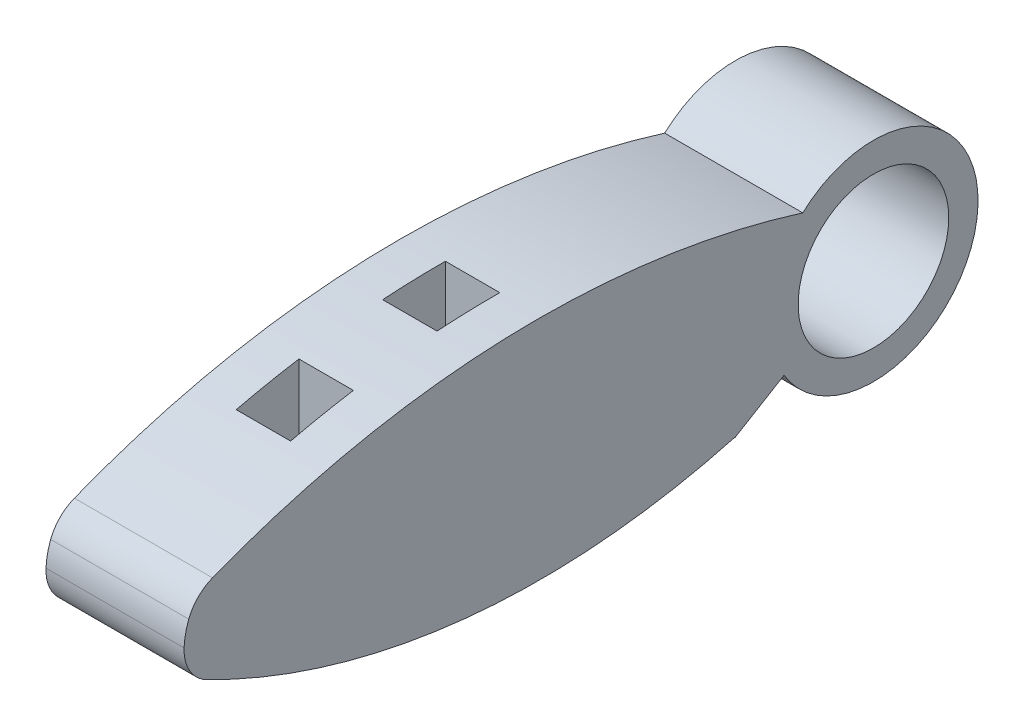
ISO-10303-21;
HEADER;
FILE_DESCRIPTION(('STEP AP214'),'2;1');
FILE_NAME('part.step','',(''),(''),'','','');
FILE_SCHEMA(('AUTOMOTIVE_DESIGN { 1 0 10303 214 1 1 1 1 }'));
ENDSEC;
DATA;
#1=APPLICATION_CONTEXT('core data for automotive mechanical design processes');
#2=APPLICATION_PROTOCOL_DEFINITION('international standard','automotive_design',2000,#1);
#3=PRODUCT_CONTEXT('',#1,'mechanical');
#4=PRODUCT('Part','Part','',(#3));
#5=PRODUCT_RELATED_PRODUCT_CATEGORY('part','',(#4));
#6=PRODUCT_DEFINITION_FORMATION('','',#4);
#7=PRODUCT_DEFINITION_CONTEXT('part definition',#1,'design');
#8=PRODUCT_DEFINITION('design','',#6,#7);
#9=PRODUCT_DEFINITION_SHAPE('','',#8);
#10=(LENGTH_UNIT() NAMED_UNIT(*) SI_UNIT(.MILLI.,.METRE.));
#11=(NAMED_UNIT(*) PLANE_ANGLE_UNIT() SI_UNIT($,.RADIAN.));
#12=(NAMED_UNIT(*) SI_UNIT($,.STERADIAN.) SOLID_ANGLE_UNIT());
#13=UNCERTAINTY_MEASURE_WITH_UNIT(LENGTH_MEASURE(1.E-05),#10,'distance_accuracy_value','');
#14=(GEOMETRIC_REPRESENTATION_CONTEXT(3) GLOBAL_UNCERTAINTY_ASSIGNED_CONTEXT((#13)) GLOBAL_UNIT_ASSIGNED_CONTEXT((#10,
#11,#12)) REPRESENTATION_CONTEXT('',''));
#15=CARTESIAN_POINT('',(0.,0.,0.));
#16=DIRECTION('',(0.,0.,1.));
#17=DIRECTION('',(1.,0.,0.));
#18=AXIS2_PLACEMENT_3D('',#15,#16,#17);
#19=CARTESIAN_POINT('',(3.048,-3.048,-10.7011292120376));
#20=DIRECTION('',(-1.,0.,0.));
#21=DIRECTION('',(0.,0.,1.));
#22=AXIS2_PLACEMENT_3D('',#19,#20,#21);
#23=PLANE('',#22);
#24=CARTESIAN_POINT('',(3.048,1.7367728611507,0.782716442123456));
#25=DIRECTION('',(-1.,0.,0.));
#26=DIRECTION('',(0.,0.,-1.));
#27=AXIS2_PLACEMENT_3D('',#24,#25,#26);
#28=CIRCLE('',#27,7.35917691072679);
#29=CARTESIAN_POINT('',(3.048,-3.048,-4.80865489866317));
#30=VERTEX_POINT('',#29);
#31=CARTESIAN_POINT('',(3.048,-4.80771955164062,4.14829274675408));
#32=VERTEX_POINT('',#31);
#33=EDGE_CURVE('E239',#30,#32,#28,.T.);
#34=ORIENTED_EDGE('',*,*,#33,.T.);
#35=CARTESIAN_POINT('',(3.048,0.,0.));
#36=DIRECTION('',(-1.,0.,0.));
#37=DIRECTION('',(0.,0.,1.));
#38=AXIS2_PLACEMENT_3D('',#35,#36,#37);
#39=CIRCLE('',#38,6.35);
#40=CARTESIAN_POINT('',(3.048,-3.048,-5.57065489866317));
#41=VERTEX_POINT('',#40);
#42=EDGE_CURVE('E311',#41,#32,#39,.T.);
#43=ORIENTED_EDGE('',*,*,#42,.F.);
#44=DIRECTION('',(0.,0.,-1.));
#45=VECTOR('',#44,1.);
#46=CARTESIAN_POINT('',(3.048,-3.048,-10.7011292120376));
#47=LINE('',#46,#45);
#48=EDGE_CURVE('E266',#30,#41,#47,.T.);
#49=ORIENTED_EDGE('',*,*,#48,.F.);
#50=EDGE_LOOP('',(#34,#43,#49));
#51=FACE_BOUND('',#50,.T.);
#52=ADVANCED_FACE('F36',(#51),#23,.F.);
#53=DIRECTION('',(0.,0.,1.));
#54=VECTOR('',#53,1.);
#55=CARTESIAN_POINT('',(3.048,-5.08,31.75));
#56=LINE('',#55,#54);
#57=CARTESIAN_POINT('',(3.048,-5.08,8.40578465095881));
#58=VERTEX_POINT('',#57);
#59=CARTESIAN_POINT('',(3.048,-5.08,8.49355854680419));
#60=VERTEX_POINT('',#59);
#61=EDGE_CURVE('E309',#58,#60,#56,.T.);
#62=ORIENTED_EDGE('',*,*,#61,.F.);
#63=DIRECTION('',(0.,-0.514252883928359,0.857638601843087));
#64=VECTOR('',#63,1.);
#65=CARTESIAN_POINT('',(3.048,-5.08,8.40578465095881));
#66=LINE('',#65,#64);
#67=CARTESIAN_POINT('',(3.048,-3.97792733114433,6.56781719878497));
#68=VERTEX_POINT('',#67);
#69=EDGE_CURVE('E447',#58,#68,#66,.F.);
#70=ORIENTED_EDGE('',*,*,#69,.T.);
#71=DIRECTION('',(0.,0.0683435239522143,0.99766184788925));
#72=VECTOR('',#71,1.);
#73=CARTESIAN_POINT('',(3.048,-3.048,20.1426662253124));
#74=LINE('',#73,#72);
#75=CARTESIAN_POINT('',(3.048,-3.048,20.1426662253124));
#76=VERTEX_POINT('',#75);
#77=EDGE_CURVE('E254',#68,#76,#74,.T.);
#78=ORIENTED_EDGE('',*,*,#77,.T.);
#79=DIRECTION('',(0.,-1.,0.));
#80=VECTOR('',#79,1.);
#81=CARTESIAN_POINT('',(3.048,-7.62,20.1426662253124));
#82=LINE('',#81,#80);
#83=CARTESIAN_POINT('',(3.048,-6.63947360129285,20.1426662253124));
#84=VERTEX_POINT('',#83);
#85=EDGE_CURVE('E306',#76,#84,#82,.T.);
#86=ORIENTED_EDGE('',*,*,#85,.T.);
#87=CARTESIAN_POINT('',(3.048,38.0452349807354,20.1956994380599));
#88=DIRECTION('',(-1.,0.,0.));
#89=DIRECTION('',(0.,0.,1.));
#90=AXIS2_PLACEMENT_3D('',#87,#88,#89);
#91=CIRCLE('',#90,44.6847400527568);
#92=EDGE_CURVE('E307',#84,#60,#91,.F.);
#93=ORIENTED_EDGE('',*,*,#92,.T.);
#94=EDGE_LOOP('',(#62,#70,#78,#86,#93));
#95=FACE_BOUND('',#94,.T.);
#96=ADVANCED_FACE('F486',(#95),#23,.F.);
#97=CARTESIAN_POINT('',(5.334,-3.048,-10.7011292120376));
#98=DIRECTION('',(1.,0.,0.));
#99=DIRECTION('',(0.,0.,-1.));
#100=AXIS2_PLACEMENT_3D('',#97,#98,#99);
#101=PLANE('',#100);
#102=CARTESIAN_POINT('',(5.334,1.7367728611507,0.782716442123456));
#103=DIRECTION('',(-1.,0.,0.));
#104=DIRECTION('',(0.,0.,-1.));
#105=AXIS2_PLACEMENT_3D('',#102,#103,#104);
#106=CIRCLE('',#105,7.35917691072679);
#107=CARTESIAN_POINT('',(5.334,-3.048,-4.80865489866317));
#108=VERTEX_POINT('',#107);
#109=CARTESIAN_POINT('',(5.334,-4.80771955164062,4.14829274675408));
#110=VERTEX_POINT('',#109);
#111=EDGE_CURVE('E259',#108,#110,#106,.T.);
#112=ORIENTED_EDGE('',*,*,#111,.F.);
#113=DIRECTION('',(0.,0.,1.));
#114=VECTOR('',#113,1.);
#115=CARTESIAN_POINT('',(5.334,-3.048,-10.7011292120376));
#116=LINE('',#115,#114);
#117=CARTESIAN_POINT('',(5.334,-3.048,-5.57065489866317));
#118=VERTEX_POINT('',#117);
#119=EDGE_CURVE('E273',#118,#108,#116,.T.);
#120=ORIENTED_EDGE('',*,*,#119,.F.);
#121=CARTESIAN_POINT('',(5.334,0.,0.));
#122=DIRECTION('',(1.,0.,0.));
#123=DIRECTION('',(0.,0.,-1.));
#124=AXIS2_PLACEMENT_3D('',#121,#122,#123);
#125=CIRCLE('',#124,6.35);
#126=EDGE_CURVE('E300',#110,#118,#125,.T.);
#127=ORIENTED_EDGE('',*,*,#126,.F.);
#128=EDGE_LOOP('',(#112,#120,#127));
#129=FACE_BOUND('',#128,.T.);
#130=ADVANCED_FACE('F514',(#129),#101,.F.);
#131=DIRECTION('',(0.,0.0683435239522143,0.99766184788925));
#132=VECTOR('',#131,1.);
#133=CARTESIAN_POINT('',(5.334,-3.048,20.1426662253124));
#134=LINE('',#133,#132);
#135=CARTESIAN_POINT('',(5.334,-3.97792733114433,6.56781719878497));
#136=VERTEX_POINT('',#135);
#137=CARTESIAN_POINT('',(5.334,-3.048,20.1426662253124));
#138=VERTEX_POINT('',#137);
#139=EDGE_CURVE('E261',#136,#138,#134,.T.);
#140=ORIENTED_EDGE('',*,*,#139,.F.);
#141=DIRECTION('',(0.,0.514252883928359,-0.857638601843087));
#142=VECTOR('',#141,1.);
#143=CARTESIAN_POINT('',(5.334,-5.08,8.40578465095881));
#144=LINE('',#143,#142);
#145=CARTESIAN_POINT('',(5.334,-5.08,8.40578465095881));
#146=VERTEX_POINT('',#145);
#147=EDGE_CURVE('E457',#136,#146,#144,.F.);
#148=ORIENTED_EDGE('',*,*,#147,.T.);
#149=DIRECTION('',(0.,0.,-1.));
#150=VECTOR('',#149,1.);
#151=CARTESIAN_POINT('',(5.334,-5.08,31.75));
#152=LINE('',#151,#150);
#153=CARTESIAN_POINT('',(5.334,-5.08,8.49355854680419));
#154=VERTEX_POINT('',#153);
#155=EDGE_CURVE('E297',#154,#146,#152,.T.);
#156=ORIENTED_EDGE('',*,*,#155,.F.);
#157=CARTESIAN_POINT('',(5.334,38.0452349807354,20.1956994380599));
#158=DIRECTION('',(1.,0.,0.));
#159=DIRECTION('',(0.,0.,-1.));
#160=AXIS2_PLACEMENT_3D('',#157,#158,#159);
#161=CIRCLE('',#160,44.6847400527568);
#162=CARTESIAN_POINT('',(5.334,-6.63947360129285,20.1426662253124));
#163=VERTEX_POINT('',#162);
#164=EDGE_CURVE('E294',#154,#163,#161,.F.);
#165=ORIENTED_EDGE('',*,*,#164,.T.);
#166=DIRECTION('',(0.,1.,0.));
#167=VECTOR('',#166,1.);
#168=CARTESIAN_POINT('',(5.334,-7.62,20.1426662253124));
#169=LINE('',#168,#167);
#170=EDGE_CURVE('E293',#163,#138,#169,.T.);
#171=ORIENTED_EDGE('',*,*,#170,.T.);
#172=EDGE_LOOP('',(#140,#148,#156,#165,#171));
#173=FACE_BOUND('',#172,.T.);
#174=ADVANCED_FACE('F474',(#173),#101,.F.);
#175=CARTESIAN_POINT('',(0.,-3.048,0.));
#176=DIRECTION('',(0.,1.,0.));
#177=DIRECTION('',(0.,0.,1.));
#178=AXIS2_PLACEMENT_3D('',#175,#176,#177);
#179=PLANE('',#178);
#180=DIRECTION('',(1.,0.,0.));
#181=VECTOR('',#180,1.);
#182=CARTESIAN_POINT('',(3.048,-3.048,-4.80865489866317));
#183=LINE('',#182,#181);
#184=EDGE_CURVE('E249',#30,#108,#183,.T.);
#185=ORIENTED_EDGE('',*,*,#184,.F.);
#186=ORIENTED_EDGE('',*,*,#48,.T.);
#187=DIRECTION('',(-1.,0.,0.));
#188=VECTOR('',#187,1.);
#189=CARTESIAN_POINT('',(8.382,-3.048,-5.57065489866317));
#190=LINE('',#189,#188);
#191=EDGE_CURVE('E286',#118,#41,#190,.T.);
#192=ORIENTED_EDGE('',*,*,#191,.F.);
#193=ORIENTED_EDGE('',*,*,#119,.T.);
#194=EDGE_LOOP('',(#185,#186,#192,#193));
#195=FACE_BOUND('',#194,.T.);
#196=ADVANCED_FACE('F511',(#195),#179,.F.);
#197=CARTESIAN_POINT('',(0.,-5.08,31.75));
#198=DIRECTION('',(0.,1.,0.));
#199=DIRECTION('',(0.,0.,1.));
#200=AXIS2_PLACEMENT_3D('',#197,#198,#199);
#201=PLANE('',#200);
#202=DIRECTION('',(0.,0.,-1.));
#203=VECTOR('',#202,1.);
#204=CARTESIAN_POINT('',(0.,-5.08,31.75));
#205=LINE('',#204,#203);
#206=CARTESIAN_POINT('',(0.,-5.08,8.49355854680419));
#207=VERTEX_POINT('',#206);
#208=CARTESIAN_POINT('',(0.,-5.08,8.40578465095881));
#209=VERTEX_POINT('',#208);
#210=EDGE_CURVE('E386',#207,#209,#205,.T.);
#211=ORIENTED_EDGE('',*,*,#210,.T.);
#212=DIRECTION('',(1.,0.,0.));
#213=VECTOR('',#212,1.);
#214=CARTESIAN_POINT('',(0.,-5.08,8.40578465095881));
#215=LINE('',#214,#213);
#216=EDGE_CURVE('E440',#209,#58,#215,.T.);
#217=ORIENTED_EDGE('',*,*,#216,.T.);
#218=ORIENTED_EDGE('',*,*,#61,.T.);
#219=DIRECTION('',(1.,0.,0.));
#220=VECTOR('',#219,1.);
#221=CARTESIAN_POINT('',(-40.0077325373367,-5.08,8.49355854680419));
#222=LINE('',#221,#220);
#223=EDGE_CURVE('E392',#60,#207,#222,.F.);
#224=ORIENTED_EDGE('',*,*,#223,.T.);
#225=EDGE_LOOP('',(#211,#217,#218,#224));
#226=FACE_BOUND('',#225,.T.);
#227=ADVANCED_FACE('F495',(#226),#201,.F.);
#228=CARTESIAN_POINT('',(-40.0077325373367,38.0452349807354,20.1956994380599));
#229=DIRECTION('',(1.,0.,0.));
#230=DIRECTION('',(0.,0.,-1.));
#231=AXIS2_PLACEMENT_3D('',#228,#229,#230);
#232=CYLINDRICAL_SURFACE('',#231,44.6847400527568);
#233=CARTESIAN_POINT('',(3.048,-5.75697970737643,29.0326662253124));
#234=VERTEX_POINT('',#233);
#235=CARTESIAN_POINT('',(3.048,-6.48128738674716,23.9526662253124));
#236=VERTEX_POINT('',#235);
#237=EDGE_CURVE('E304',#234,#236,#91,.F.);
#238=ORIENTED_EDGE('',*,*,#237,.F.);
#239=DIRECTION('',(1.,0.,0.));
#240=VECTOR('',#239,1.);
#241=CARTESIAN_POINT('',(-40.0077325373367,-5.75697970737642,29.0326662253124));
#242=LINE('',#241,#240);
#243=CARTESIAN_POINT('',(2.54,-5.75697970737642,29.0326662253124));
#244=VERTEX_POINT('',#243);
#245=EDGE_CURVE('E357',#234,#244,#242,.F.);
#246=ORIENTED_EDGE('',*,*,#245,.T.);
#247=CARTESIAN_POINT('',(2.54,38.0452349807354,20.1956994380599));
#248=DIRECTION('',(1.,0.,0.));
#249=DIRECTION('',(0.,0.,-1.));
#250=AXIS2_PLACEMENT_3D('',#247,#248,#249);
#251=CIRCLE('',#250,44.6847400527568);
#252=CARTESIAN_POINT('',(2.54,-4.81243906563084,32.8426662253124));
#253=VERTEX_POINT('',#252);
#254=EDGE_CURVE('E361',#244,#253,#251,.F.);
#255=ORIENTED_EDGE('',*,*,#254,.T.);
#256=DIRECTION('',(1.,0.,0.));
#257=VECTOR('',#256,1.);
#258=CARTESIAN_POINT('',(-40.0077325373367,-4.81243906563084,32.8426662253124));
#259=LINE('',#258,#257);
#260=CARTESIAN_POINT('',(5.842,-4.81243906563084,32.8426662253124));
#261=VERTEX_POINT('',#260);
#262=EDGE_CURVE('E351',#253,#261,#259,.T.);
#263=ORIENTED_EDGE('',*,*,#262,.T.);
#264=CARTESIAN_POINT('',(5.842,38.0452349807354,20.1956994380599));
#265=DIRECTION('',(-1.,0.,0.));
#266=DIRECTION('',(0.,0.,1.));
#267=AXIS2_PLACEMENT_3D('',#264,#265,#266);
#268=CIRCLE('',#267,44.6847400527568);
#269=CARTESIAN_POINT('',(5.842,-5.75697970737643,29.0326662253124));
#270=VERTEX_POINT('',#269);
#271=EDGE_CURVE('E354',#261,#270,#268,.F.);
#272=ORIENTED_EDGE('',*,*,#271,.T.);
#273=CARTESIAN_POINT('',(5.334,-5.75697970737643,29.0326662253124));
#274=VERTEX_POINT('',#273);
#275=EDGE_CURVE('E358',#270,#274,#242,.F.);
#276=ORIENTED_EDGE('',*,*,#275,.T.);
#277=CARTESIAN_POINT('',(5.334,-6.48128738674716,23.9526662253124));
#278=VERTEX_POINT('',#277);
#279=EDGE_CURVE('E291',#278,#274,#161,.F.);
#280=ORIENTED_EDGE('',*,*,#279,.F.);
#281=DIRECTION('',(1.,0.,0.));
#282=VECTOR('',#281,1.);
#283=CARTESIAN_POINT('',(-40.0077325373367,-6.48128738674716,23.9526662253124));
#284=LINE('',#283,#282);
#285=CARTESIAN_POINT('',(5.842,-6.48128738674716,23.9526662253124));
#286=VERTEX_POINT('',#285);
#287=EDGE_CURVE('E327',#278,#286,#284,.T.);
#288=ORIENTED_EDGE('',*,*,#287,.T.);
#289=CARTESIAN_POINT('',(5.842,38.0452349807354,20.1956994380599));
#290=DIRECTION('',(-1.,0.,0.));
#291=DIRECTION('',(0.,0.,1.));
#292=AXIS2_PLACEMENT_3D('',#289,#290,#291);
#293=CIRCLE('',#292,44.6847400527568);
#294=CARTESIAN_POINT('',(5.842,-6.63947360129285,20.1426662253124));
#295=VERTEX_POINT('',#294);
#296=EDGE_CURVE('E341',#286,#295,#293,.F.);
#297=ORIENTED_EDGE('',*,*,#296,.T.);
#298=DIRECTION('',(1.,0.,0.));
#299=VECTOR('',#298,1.);
#300=CARTESIAN_POINT('',(-40.0077325373367,-6.63947360129284,20.1426662253124));
#301=LINE('',#300,#299);
#302=EDGE_CURVE('E345',#295,#163,#301,.F.);
#303=ORIENTED_EDGE('',*,*,#302,.T.);
#304=ORIENTED_EDGE('',*,*,#164,.F.);
#305=CARTESIAN_POINT('',(8.382,-5.08,8.49355854680419));
#306=VERTEX_POINT('',#305);
#307=EDGE_CURVE('E395',#306,#154,#222,.F.);
#308=ORIENTED_EDGE('',*,*,#307,.F.);
#309=CARTESIAN_POINT('',(8.382,38.0452349807354,20.1956994380599));
#310=DIRECTION('',(1.,0.,0.));
#311=DIRECTION('',(0.,0.,1.));
#312=AXIS2_PLACEMENT_3D('',#309,#310,#311);
#313=CIRCLE('',#312,44.6847400527568);
#314=CARTESIAN_POINT('',(8.382,-1.77907983856623,40.4626662253124));
#315=VERTEX_POINT('',#314);
#316=EDGE_CURVE('E374',#315,#306,#313,.T.);
#317=ORIENTED_EDGE('',*,*,#316,.F.);
#318=DIRECTION('',(1.,0.,0.));
#319=VECTOR('',#318,1.);
#320=CARTESIAN_POINT('',(-40.0077325373367,-1.77907983856622,40.4626662253124));
#321=LINE('',#320,#319);
#322=CARTESIAN_POINT('',(0.,-1.77907983856623,40.4626662253124));
#323=VERTEX_POINT('',#322);
#324=EDGE_CURVE('E407',#315,#323,#321,.F.);
#325=ORIENTED_EDGE('',*,*,#324,.T.);
#326=CARTESIAN_POINT('',(0.,38.0452349807354,20.1956994380599));
#327=DIRECTION('',(1.,0.,0.));
#328=DIRECTION('',(0.,0.,-1.));
#329=AXIS2_PLACEMENT_3D('',#326,#327,#328);
#330=CIRCLE('',#329,44.6847400527568);
#331=EDGE_CURVE('E371',#207,#323,#330,.F.);
#332=ORIENTED_EDGE('',*,*,#331,.F.);
#333=ORIENTED_EDGE('',*,*,#223,.F.);
#334=ORIENTED_EDGE('',*,*,#92,.F.);
#335=CARTESIAN_POINT('',(2.54,-6.63947360129284,20.1426662253124));
#336=VERTEX_POINT('',#335);
#337=EDGE_CURVE('E344',#84,#336,#301,.F.);
#338=ORIENTED_EDGE('',*,*,#337,.T.);
#339=CARTESIAN_POINT('',(2.54,38.0452349807354,20.1956994380599));
#340=DIRECTION('',(1.,0.,0.));
#341=DIRECTION('',(0.,0.,-1.));
#342=AXIS2_PLACEMENT_3D('',#339,#340,#341);
#343=CIRCLE('',#342,44.6847400527568);
#344=CARTESIAN_POINT('',(2.54,-6.48128738674716,23.9526662253124));
#345=VERTEX_POINT('',#344);
#346=EDGE_CURVE('E348',#336,#345,#343,.F.);
#347=ORIENTED_EDGE('',*,*,#346,.T.);
#348=EDGE_CURVE('E338',#345,#236,#284,.T.);
#349=ORIENTED_EDGE('',*,*,#348,.T.);
#350=EDGE_LOOP('',(#238,#246,#255,#263,#272,#276,#280,#288,#297,#303,#304,#308,#317,#325,#332,
#333,#334,#338,#347,#349));
#351=FACE_BOUND('',#350,.T.);
#352=ADVANCED_FACE('F490',(#351),#232,.T.);
#353=CARTESIAN_POINT('',(-40.0077325373367,-46.8189051598861,20.4005244242763));
#354=DIRECTION('',(1.,0.,0.));
#355=DIRECTION('',(0.,0.,-1.));
#356=AXIS2_PLACEMENT_3D('',#353,#354,#355);
#357=CYLINDRICAL_SURFACE('',#356,53.9591517799114);
#358=CARTESIAN_POINT('',(0.,-46.8189051598861,20.4005244242763));
#359=DIRECTION('',(1.,0.,0.));
#360=DIRECTION('',(0.,0.,-1.));
#361=AXIS2_PLACEMENT_3D('',#358,#359,#360);
#362=CIRCLE('',#361,53.9591517799114);
#363=CARTESIAN_POINT('',(0.,3.40624560674951,40.1242231462766));
#364=VERTEX_POINT('',#363);
#365=CARTESIAN_POINT('',(0.,4.67973864627517,4.29214936862159));
#366=VERTEX_POINT('',#365);
#367=EDGE_CURVE('E365',#364,#366,#362,.F.);
#368=ORIENTED_EDGE('',*,*,#367,.F.);
#369=DIRECTION('',(1.,0.,0.));
#370=VECTOR('',#369,1.);
#371=CARTESIAN_POINT('',(-40.0077325373367,3.40624560674951,40.1242231462766));
#372=LINE('',#371,#370);
#373=CARTESIAN_POINT('',(8.382,3.40624560674951,40.1242231462766));
#374=VERTEX_POINT('',#373);
#375=EDGE_CURVE('E413',#364,#374,#372,.T.);
#376=ORIENTED_EDGE('',*,*,#375,.T.);
#377=CARTESIAN_POINT('',(8.382,-46.8189051598861,20.4005244242763));
#378=DIRECTION('',(1.,0.,0.));
#379=DIRECTION('',(0.,0.,-1.));
#380=AXIS2_PLACEMENT_3D('',#377,#378,#379);
#381=CIRCLE('',#380,53.9591517799114);
#382=CARTESIAN_POINT('',(8.382,4.67973864627517,4.29214936862158));
#383=VERTEX_POINT('',#382);
#384=EDGE_CURVE('E376',#383,#374,#381,.T.);
#385=ORIENTED_EDGE('',*,*,#384,.F.);
#386=DIRECTION('',(1.,0.,0.));
#387=VECTOR('',#386,1.);
#388=CARTESIAN_POINT('',(-40.0077325373367,4.67973864627517,4.29214936862159));
#389=LINE('',#388,#387);
#390=EDGE_CURVE('E368',#366,#383,#389,.T.);
#391=ORIENTED_EDGE('',*,*,#390,.F.);
#392=EDGE_LOOP('',(#368,#376,#385,#391));
#393=FACE_BOUND('',#392,.T.);
#394=DIRECTION('',(1.,0.,0.));
#395=VECTOR('',#394,1.);
#396=CARTESIAN_POINT('',(-40.0077325373367,7.13963049441738,20.1426662253124));
#397=LINE('',#396,#395);
#398=CARTESIAN_POINT('',(2.54,7.13963049441738,20.1426662253124));
#399=VERTEX_POINT('',#398);
#400=CARTESIAN_POINT('',(5.842,7.13963049441738,20.1426662253124));
#401=VERTEX_POINT('',#400);
#402=EDGE_CURVE('E425',#399,#401,#397,.T.);
#403=ORIENTED_EDGE('',*,*,#402,.T.);
#404=CARTESIAN_POINT('',(5.842,-46.8189051598861,20.4005244242763));
#405=DIRECTION('',(-1.,0.,0.));
#406=DIRECTION('',(0.,0.,1.));
#407=AXIS2_PLACEMENT_3D('',#404,#405,#406);
#408=CIRCLE('',#407,53.9591517799114);
#409=CARTESIAN_POINT('',(5.842,7.02320057004282,23.9526662253124));
#410=VERTEX_POINT('',#409);
#411=EDGE_CURVE('E416',#401,#410,#408,.F.);
#412=ORIENTED_EDGE('',*,*,#411,.T.);
#413=DIRECTION('',(1.,0.,0.));
#414=VECTOR('',#413,1.);
#415=CARTESIAN_POINT('',(-40.0077325373367,7.02320057004282,23.9526662253124));
#416=LINE('',#415,#414);
#417=CARTESIAN_POINT('',(2.54,7.02320057004282,23.9526662253124));
#418=VERTEX_POINT('',#417);
#419=EDGE_CURVE('E422',#410,#418,#416,.F.);
#420=ORIENTED_EDGE('',*,*,#419,.T.);
#421=CARTESIAN_POINT('',(2.54,-46.8189051598861,20.4005244242763));
#422=DIRECTION('',(1.,0.,0.));
#423=DIRECTION('',(0.,0.,-1.));
#424=AXIS2_PLACEMENT_3D('',#421,#422,#423);
#425=CIRCLE('',#424,53.9591517799114);
#426=EDGE_CURVE('E419',#418,#399,#425,.F.);
#427=ORIENTED_EDGE('',*,*,#426,.T.);
#428=EDGE_LOOP('',(#403,#412,#420,#427));
#429=FACE_BOUND('',#428,.T.);
#430=DIRECTION('',(1.,0.,0.));
#431=VECTOR('',#430,1.);
#432=CARTESIAN_POINT('',(-40.0077325373367,5.68617238705618,32.8426662253124));
#433=LINE('',#432,#431);
#434=CARTESIAN_POINT('',(5.842,5.68617238705618,32.8426662253124));
#435=VERTEX_POINT('',#434);
#436=CARTESIAN_POINT('',(2.54,5.68617238705618,32.8426662253124));
#437=VERTEX_POINT('',#436);
#438=EDGE_CURVE('E428',#435,#437,#433,.F.);
#439=ORIENTED_EDGE('',*,*,#438,.T.);
#440=CARTESIAN_POINT('',(2.54,-46.8189051598861,20.4005244242763));
#441=DIRECTION('',(1.,0.,0.));
#442=DIRECTION('',(0.,0.,-1.));
#443=AXIS2_PLACEMENT_3D('',#440,#441,#442);
#444=CIRCLE('',#443,53.9591517799114);
#445=CARTESIAN_POINT('',(2.54,6.44530598356666,29.0326662253124));
#446=VERTEX_POINT('',#445);
#447=EDGE_CURVE('E437',#437,#446,#444,.F.);
#448=ORIENTED_EDGE('',*,*,#447,.T.);
#449=DIRECTION('',(1.,0.,0.));
#450=VECTOR('',#449,1.);
#451=CARTESIAN_POINT('',(-40.0077325373367,6.44530598356666,29.0326662253124));
#452=LINE('',#451,#450);
#453=CARTESIAN_POINT('',(5.842,6.44530598356667,29.0326662253124));
#454=VERTEX_POINT('',#453);
#455=EDGE_CURVE('E434',#446,#454,#452,.T.);
#456=ORIENTED_EDGE('',*,*,#455,.T.);
#457=CARTESIAN_POINT('',(5.842,-46.8189051598861,20.4005244242763));
#458=DIRECTION('',(-1.,0.,0.));
#459=DIRECTION('',(0.,0.,1.));
#460=AXIS2_PLACEMENT_3D('',#457,#458,#459);
#461=CIRCLE('',#460,53.9591517799114);
#462=EDGE_CURVE('E431',#454,#435,#461,.F.);
#463=ORIENTED_EDGE('',*,*,#462,.T.);
#464=EDGE_LOOP('',(#439,#448,#456,#463));
#465=FACE_BOUND('',#464,.T.);
#466=ADVANCED_FACE('F550',(#393,#429,#465),#357,.T.);
#467=CARTESIAN_POINT('',(8.382,0.,0.));
#468=DIRECTION('',(-1.,0.,0.));
#469=DIRECTION('',(0.,0.,1.));
#470=AXIS2_PLACEMENT_3D('',#467,#468,#469);
#471=CYLINDRICAL_SURFACE('',#470,6.35);
#472=ORIENTED_EDGE('',*,*,#191,.T.);
#473=ORIENTED_EDGE('',*,*,#42,.T.);
#474=CARTESIAN_POINT('',(3.048,0.,0.));
#475=DIRECTION('',(1.,0.,0.));
#476=DIRECTION('',(0.,0.,-1.));
#477=AXIS2_PLACEMENT_3D('',#474,#475,#476);
#478=CIRCLE('',#477,6.35);
#479=CARTESIAN_POINT('',(3.048,-3.29470856296933,5.42838792691685));
#480=VERTEX_POINT('',#479);
#481=EDGE_CURVE('E236',#480,#32,#478,.T.);
#482=ORIENTED_EDGE('',*,*,#481,.F.);
#483=DIRECTION('',(-1.,0.,0.));
#484=VECTOR('',#483,1.);
#485=CARTESIAN_POINT('',(1.524,-3.29470856296933,5.42838792691685));
#486=LINE('',#485,#484);
#487=CARTESIAN_POINT('',(0.,-3.29470856296933,5.42838792691685));
#488=VERTEX_POINT('',#487);
#489=EDGE_CURVE('E461',#480,#488,#486,.T.);
#490=ORIENTED_EDGE('',*,*,#489,.T.);
#491=CARTESIAN_POINT('',(0.,0.,0.));
#492=DIRECTION('',(1.,0.,0.));
#493=DIRECTION('',(0.,0.,-1.));
#494=AXIS2_PLACEMENT_3D('',#491,#492,#493);
#495=CIRCLE('',#494,6.35);
#496=EDGE_CURVE('E389',#488,#366,#495,.T.);
#497=ORIENTED_EDGE('',*,*,#496,.T.);
#498=ORIENTED_EDGE('',*,*,#390,.T.);
#499=CARTESIAN_POINT('',(8.382,0.,0.));
#500=DIRECTION('',(1.,0.,0.));
#501=DIRECTION('',(0.,0.,-1.));
#502=AXIS2_PLACEMENT_3D('',#499,#500,#501);
#503=CIRCLE('',#502,6.35);
#504=CARTESIAN_POINT('',(8.382,-3.29470856296933,5.42838792691685));
#505=VERTEX_POINT('',#504);
#506=EDGE_CURVE('E390',#505,#383,#503,.T.);
#507=ORIENTED_EDGE('',*,*,#506,.F.);
#508=DIRECTION('',(-1.,0.,0.));
#509=VECTOR('',#508,1.);
#510=CARTESIAN_POINT('',(6.858,-3.29470856296933,5.42838792691685));
#511=LINE('',#510,#509);
#512=CARTESIAN_POINT('',(5.334,-3.29470856296932,5.42838792691685));
#513=VERTEX_POINT('',#512);
#514=EDGE_CURVE('E45',#505,#513,#511,.T.);
#515=ORIENTED_EDGE('',*,*,#514,.T.);
#516=EDGE_CURVE('E52',#513,#110,#125,.T.);
#517=ORIENTED_EDGE('',*,*,#516,.T.);
#518=ORIENTED_EDGE('',*,*,#126,.T.);
#519=EDGE_LOOP('',(#472,#473,#482,#490,#497,#498,#507,#515,#517,#518));
#520=FACE_BOUND('',#519,.T.);
#521=ADVANCED_FACE('F467',(#520),#471,.T.);
#522=CARTESIAN_POINT('',(8.382,0.,0.));
#523=DIRECTION('',(1.,0.,0.));
#524=DIRECTION('',(0.,0.,-1.));
#525=AXIS2_PLACEMENT_3D('',#522,#523,#524);
#526=PLANE('',#525);
#527=CARTESIAN_POINT('',(8.382,0.,0.));
#528=DIRECTION('',(1.,0.,0.));
#529=DIRECTION('',(0.,0.,-1.));
#530=AXIS2_PLACEMENT_3D('',#527,#528,#529);
#531=CIRCLE('',#530,4.572);
#532=CARTESIAN_POINT('',(8.382,0.,-4.572));
#533=VERTEX_POINT('',#532);
#534=EDGE_CURVE('E444',#533,#533,#531,.T.);
#535=ORIENTED_EDGE('',*,*,#534,.F.);
#536=EDGE_LOOP('',(#535));
#537=FACE_BOUND('',#536,.T.);
#538=DIRECTION('',(0.,-0.514252883928359,0.857638601843087));
#539=VECTOR('',#538,1.);
#540=CARTESIAN_POINT('',(8.382,-0.0292498493591167,-0.0175386454796584));
#541=LINE('',#540,#539);
#542=CARTESIAN_POINT('',(8.382,-5.08,8.40578465095881));
#543=VERTEX_POINT('',#542);
#544=EDGE_CURVE('E454',#543,#505,#541,.F.);
#545=ORIENTED_EDGE('',*,*,#544,.T.);
#546=ORIENTED_EDGE('',*,*,#506,.T.);
#547=ORIENTED_EDGE('',*,*,#384,.T.);
#548=CARTESIAN_POINT('',(8.382,1.04201491113748,39.1957764768734));
#549=DIRECTION('',(1.,0.,0.));
#550=DIRECTION('',(0.,0.,-1.));
#551=AXIS2_PLACEMENT_3D('',#548,#549,#550);
#552=CIRCLE('',#551,2.54);
#553=CARTESIAN_POINT('',(8.382,1.95548785196759,41.565832844636));
#554=VERTEX_POINT('',#553);
#555=EDGE_CURVE('E403',#374,#554,#552,.T.);
#556=ORIENTED_EDGE('',*,*,#555,.T.);
#557=CARTESIAN_POINT('',(8.382,0.417673082929495,37.5758868671602));
#558=DIRECTION('',(1.,0.,0.));
#559=DIRECTION('',(0.,0.,-1.));
#560=AXIS2_PLACEMENT_3D('',#557,#558,#559);
#561=CIRCLE('',#560,4.27604293325584);
#562=CARTESIAN_POINT('',(8.382,0.582620619965635,41.8487472062156));
#563=VERTEX_POINT('',#562);
#564=EDGE_CURVE('E364',#554,#563,#561,.T.);
#565=ORIENTED_EDGE('',*,*,#564,.T.);
#566=CARTESIAN_POINT('',(8.382,0.484640606525314,39.3106376898696));
#567=DIRECTION('',(1.,0.,0.));
#568=DIRECTION('',(0.,0.,-1.));
#569=AXIS2_PLACEMENT_3D('',#566,#567,#568);
#570=CIRCLE('',#569,2.54);
#571=EDGE_CURVE('E405',#563,#315,#570,.T.);
#572=ORIENTED_EDGE('',*,*,#571,.T.);
#573=ORIENTED_EDGE('',*,*,#316,.T.);
#574=DIRECTION('',(0.,0.,-1.));
#575=VECTOR('',#574,1.);
#576=CARTESIAN_POINT('',(8.382,-5.08,31.75));
#577=LINE('',#576,#575);
#578=EDGE_CURVE('E383',#306,#543,#577,.T.);
#579=ORIENTED_EDGE('',*,*,#578,.T.);
#580=EDGE_LOOP('',(#545,#546,#547,#556,#565,#572,#573,#579));
#581=FACE_BOUND('',#580,.T.);
#582=ADVANCED_FACE('F583',(#537,#581),#526,.T.);
#583=CARTESIAN_POINT('',(0.,0.,0.));
#584=DIRECTION('',(1.,0.,0.));
#585=DIRECTION('',(0.,0.,-1.));
#586=AXIS2_PLACEMENT_3D('',#583,#584,#585);
#587=PLANE('',#586);
#588=CARTESIAN_POINT('',(0.,0.,0.));
#589=DIRECTION('',(1.,0.,0.));
#590=DIRECTION('',(0.,0.,-1.));
#591=AXIS2_PLACEMENT_3D('',#588,#589,#590);
#592=CIRCLE('',#591,4.572);
#593=CARTESIAN_POINT('',(0.,0.,-4.572));
#594=VERTEX_POINT('',#593);
#595=EDGE_CURVE('E441',#594,#594,#592,.T.);
#596=ORIENTED_EDGE('',*,*,#595,.T.);
#597=EDGE_LOOP('',(#596));
#598=FACE_BOUND('',#597,.T.);
#599=ORIENTED_EDGE('',*,*,#496,.F.);
#600=DIRECTION('',(0.,0.514252883928359,-0.857638601843087));
#601=VECTOR('',#600,1.);
#602=CARTESIAN_POINT('',(0.,-5.08,8.40578465095881));
#603=LINE('',#602,#601);
#604=EDGE_CURVE('E449',#488,#209,#603,.F.);
#605=ORIENTED_EDGE('',*,*,#604,.T.);
#606=ORIENTED_EDGE('',*,*,#210,.F.);
#607=ORIENTED_EDGE('',*,*,#331,.T.);
#608=CARTESIAN_POINT('',(0.,0.484640606525314,39.3106376898696));
#609=DIRECTION('',(1.,0.,0.));
#610=DIRECTION('',(0.,0.,-1.));
#611=AXIS2_PLACEMENT_3D('',#608,#609,#610);
#612=CIRCLE('',#611,2.54);
#613=CARTESIAN_POINT('',(0.,0.582620619965635,41.8487472062156));
#614=VERTEX_POINT('',#613);
#615=EDGE_CURVE('E411',#323,#614,#612,.F.);
#616=ORIENTED_EDGE('',*,*,#615,.T.);
#617=CARTESIAN_POINT('',(0.,0.417673082929495,37.5758868671602));
#618=DIRECTION('',(1.,0.,0.));
#619=DIRECTION('',(0.,0.,-1.));
#620=AXIS2_PLACEMENT_3D('',#617,#618,#619);
#621=CIRCLE('',#620,4.27604293325584);
#622=CARTESIAN_POINT('',(0.,1.95548785196759,41.565832844636));
#623=VERTEX_POINT('',#622);
#624=EDGE_CURVE('E367',#614,#623,#621,.F.);
#625=ORIENTED_EDGE('',*,*,#624,.T.);
#626=CARTESIAN_POINT('',(0.,1.04201491113748,39.1957764768734));
#627=DIRECTION('',(1.,0.,0.));
#628=DIRECTION('',(0.,0.,-1.));
#629=AXIS2_PLACEMENT_3D('',#626,#627,#628);
#630=CIRCLE('',#629,2.54);
#631=EDGE_CURVE('E409',#623,#364,#630,.F.);
#632=ORIENTED_EDGE('',*,*,#631,.T.);
#633=ORIENTED_EDGE('',*,*,#367,.T.);
#634=EDGE_LOOP('',(#599,#605,#606,#607,#616,#625,#632,#633));
#635=FACE_BOUND('',#634,.T.);
#636=ADVANCED_FACE('F498',(#598,#635),#587,.F.);
#637=ORIENTED_EDGE('',*,*,#155,.T.);
#638=DIRECTION('',(1.,0.,0.));
#639=VECTOR('',#638,1.);
#640=CARTESIAN_POINT('',(0.,-5.08,8.40578465095881));
#641=LINE('',#640,#639);
#642=EDGE_CURVE('E451',#146,#543,#641,.T.);
#643=ORIENTED_EDGE('',*,*,#642,.T.);
#644=ORIENTED_EDGE('',*,*,#578,.F.);
#645=ORIENTED_EDGE('',*,*,#307,.T.);
#646=EDGE_LOOP('',(#637,#643,#644,#645));
#647=FACE_BOUND('',#646,.T.);
#648=ADVANCED_FACE('F594',(#647),#201,.F.);
#649=CARTESIAN_POINT('',(-40.0077325373367,0.417673082929495,37.5758868671602));
#650=DIRECTION('',(1.,0.,0.));
#651=DIRECTION('',(0.,0.,-1.));
#652=AXIS2_PLACEMENT_3D('',#649,#650,#651);
#653=CYLINDRICAL_SURFACE('',#652,4.27604293325584);
#654=ORIENTED_EDGE('',*,*,#624,.F.);
#655=DIRECTION('',(1.,0.,0.));
#656=VECTOR('',#655,1.);
#657=CARTESIAN_POINT('',(-40.0077325373367,0.582620619965635,41.8487472062156));
#658=LINE('',#657,#656);
#659=EDGE_CURVE('E400',#614,#563,#658,.T.);
#660=ORIENTED_EDGE('',*,*,#659,.T.);
#661=ORIENTED_EDGE('',*,*,#564,.F.);
#662=DIRECTION('',(1.,0.,0.));
#663=VECTOR('',#662,1.);
#664=CARTESIAN_POINT('',(-40.0077325373367,1.95548785196759,41.565832844636));
#665=LINE('',#664,#663);
#666=EDGE_CURVE('E398',#554,#623,#665,.F.);
#667=ORIENTED_EDGE('',*,*,#666,.T.);
#668=EDGE_LOOP('',(#654,#660,#661,#667));
#669=FACE_BOUND('',#668,.T.);
#670=ADVANCED_FACE('F590',(#669),#653,.T.);
#671=CARTESIAN_POINT('',(-40.0077325373367,0.484640606525314,39.3106376898696));
#672=DIRECTION('',(1.,0.,0.));
#673=DIRECTION('',(0.,0.,-1.));
#674=AXIS2_PLACEMENT_3D('',#671,#672,#673);
#675=CYLINDRICAL_SURFACE('',#674,2.54);
#676=ORIENTED_EDGE('',*,*,#615,.F.);
#677=ORIENTED_EDGE('',*,*,#324,.F.);
#678=ORIENTED_EDGE('',*,*,#571,.F.);
#679=ORIENTED_EDGE('',*,*,#659,.F.);
#680=EDGE_LOOP('',(#676,#677,#678,#679));
#681=FACE_BOUND('',#680,.T.);
#682=ADVANCED_FACE('F593',(#681),#675,.T.);
#683=CARTESIAN_POINT('',(-40.0077325373367,1.04201491113748,39.1957764768734));
#684=DIRECTION('',(1.,0.,0.));
#685=DIRECTION('',(0.,0.,-1.));
#686=AXIS2_PLACEMENT_3D('',#683,#684,#685);
#687=CYLINDRICAL_SURFACE('',#686,2.54);
#688=ORIENTED_EDGE('',*,*,#631,.F.);
#689=ORIENTED_EDGE('',*,*,#666,.F.);
#690=ORIENTED_EDGE('',*,*,#555,.F.);
#691=ORIENTED_EDGE('',*,*,#375,.F.);
#692=EDGE_LOOP('',(#688,#689,#690,#691));
#693=FACE_BOUND('',#692,.T.);
#694=ADVANCED_FACE('F607',(#693),#687,.T.);
#695=CARTESIAN_POINT('',(2.54,-7.62,20.1426662253124));
#696=DIRECTION('',(1.,0.,0.));
#697=DIRECTION('',(0.,0.,-1.));
#698=AXIS2_PLACEMENT_3D('',#695,#696,#697);
#699=PLANE('',#698);
#700=DIRECTION('',(0.,1.,0.));
#701=VECTOR('',#700,1.);
#702=CARTESIAN_POINT('',(2.54,-7.62,20.1426662253124));
#703=LINE('',#702,#701);
#704=EDGE_CURVE('E318',#336,#399,#703,.T.);
#705=ORIENTED_EDGE('',*,*,#704,.T.);
#706=ORIENTED_EDGE('',*,*,#426,.F.);
#707=DIRECTION('',(0.,1.,0.));
#708=VECTOR('',#707,1.);
#709=CARTESIAN_POINT('',(2.54,-7.62,23.9526662253124));
#710=LINE('',#709,#708);
#711=EDGE_CURVE('E314',#345,#418,#710,.T.);
#712=ORIENTED_EDGE('',*,*,#711,.F.);
#713=ORIENTED_EDGE('',*,*,#346,.F.);
#714=EDGE_LOOP('',(#705,#706,#712,#713));
#715=FACE_BOUND('',#714,.T.);
#716=ADVANCED_FACE('F547',(#715),#699,.T.);
#717=CARTESIAN_POINT('',(2.54,-7.62,20.1426662253124));
#718=DIRECTION('',(0.,0.,1.));
#719=DIRECTION('',(1.,0.,0.));
#720=AXIS2_PLACEMENT_3D('',#717,#718,#719);
#721=PLANE('',#720);
#722=ORIENTED_EDGE('',*,*,#85,.F.);
#723=DIRECTION('',(-1.,0.,0.));
#724=VECTOR('',#723,1.);
#725=CARTESIAN_POINT('',(2.54,-3.048,20.1426662253124));
#726=LINE('',#725,#724);
#727=EDGE_CURVE('E284',#138,#76,#726,.T.);
#728=ORIENTED_EDGE('',*,*,#727,.F.);
#729=ORIENTED_EDGE('',*,*,#170,.F.);
#730=ORIENTED_EDGE('',*,*,#302,.F.);
#731=DIRECTION('',(0.,1.,0.));
#732=VECTOR('',#731,1.);
#733=CARTESIAN_POINT('',(5.842,-7.62,20.1426662253124));
#734=LINE('',#733,#732);
#735=EDGE_CURVE('E333',#295,#401,#734,.T.);
#736=ORIENTED_EDGE('',*,*,#735,.T.);
#737=ORIENTED_EDGE('',*,*,#402,.F.);
#738=ORIENTED_EDGE('',*,*,#704,.F.);
#739=ORIENTED_EDGE('',*,*,#337,.F.);
#740=EDGE_LOOP('',(#722,#728,#729,#730,#736,#737,#738,#739));
#741=FACE_BOUND('',#740,.T.);
#742=ADVANCED_FACE('F479',(#741),#721,.T.);
#743=CARTESIAN_POINT('',(5.842,-7.62,20.1426662253124));
#744=DIRECTION('',(-1.,0.,0.));
#745=DIRECTION('',(0.,0.,1.));
#746=AXIS2_PLACEMENT_3D('',#743,#744,#745);
#747=PLANE('',#746);
#748=DIRECTION('',(0.,1.,0.));
#749=VECTOR('',#748,1.);
#750=CARTESIAN_POINT('',(5.842,-7.62,23.9526662253124));
#751=LINE('',#750,#749);
#752=EDGE_CURVE('E330',#286,#410,#751,.T.);
#753=ORIENTED_EDGE('',*,*,#752,.T.);
#754=ORIENTED_EDGE('',*,*,#411,.F.);
#755=ORIENTED_EDGE('',*,*,#735,.F.);
#756=ORIENTED_EDGE('',*,*,#296,.F.);
#757=EDGE_LOOP('',(#753,#754,#755,#756));
#758=FACE_BOUND('',#757,.T.);
#759=ADVANCED_FACE('F556',(#758),#747,.T.);
#760=CARTESIAN_POINT('',(2.54,-7.62,23.9526662253124));
#761=DIRECTION('',(0.,0.,-1.));
#762=DIRECTION('',(-1.,0.,0.));
#763=AXIS2_PLACEMENT_3D('',#760,#761,#762);
#764=PLANE('',#763);
#765=DIRECTION('',(0.,1.,0.));
#766=VECTOR('',#765,1.);
#767=CARTESIAN_POINT('',(3.048,-7.62,23.9526662253124));
#768=LINE('',#767,#766);
#769=CARTESIAN_POINT('',(3.048,-3.048,23.9526662253124));
#770=VERTEX_POINT('',#769);
#771=EDGE_CURVE('E302',#236,#770,#768,.T.);
#772=ORIENTED_EDGE('',*,*,#771,.F.);
#773=ORIENTED_EDGE('',*,*,#348,.F.);
#774=ORIENTED_EDGE('',*,*,#711,.T.);
#775=ORIENTED_EDGE('',*,*,#419,.F.);
#776=ORIENTED_EDGE('',*,*,#752,.F.);
#777=ORIENTED_EDGE('',*,*,#287,.F.);
#778=DIRECTION('',(0.,-1.,0.));
#779=VECTOR('',#778,1.);
#780=CARTESIAN_POINT('',(5.334,-7.62,23.9526662253124));
#781=LINE('',#780,#779);
#782=CARTESIAN_POINT('',(5.334,-3.048,23.9526662253124));
#783=VERTEX_POINT('',#782);
#784=EDGE_CURVE('E289',#783,#278,#781,.T.);
#785=ORIENTED_EDGE('',*,*,#784,.F.);
#786=DIRECTION('',(1.,0.,0.));
#787=VECTOR('',#786,1.);
#788=CARTESIAN_POINT('',(2.54,-3.048,23.9526662253124));
#789=LINE('',#788,#787);
#790=EDGE_CURVE('E280',#770,#783,#789,.T.);
#791=ORIENTED_EDGE('',*,*,#790,.F.);
#792=EDGE_LOOP('',(#772,#773,#774,#775,#776,#777,#785,#791));
#793=FACE_BOUND('',#792,.T.);
#794=ADVANCED_FACE('F543',(#793),#764,.T.);
#795=CARTESIAN_POINT('',(2.54,-7.62,29.0326662253124));
#796=DIRECTION('',(1.,0.,0.));
#797=DIRECTION('',(0.,0.,-1.));
#798=AXIS2_PLACEMENT_3D('',#795,#796,#797);
#799=PLANE('',#798);
#800=DIRECTION('',(0.,1.,0.));
#801=VECTOR('',#800,1.);
#802=CARTESIAN_POINT('',(2.54,-7.62,29.0326662253124));
#803=LINE('',#802,#801);
#804=EDGE_CURVE('E324',#244,#446,#803,.T.);
#805=ORIENTED_EDGE('',*,*,#804,.T.);
#806=ORIENTED_EDGE('',*,*,#447,.F.);
#807=DIRECTION('',(0.,1.,0.));
#808=VECTOR('',#807,1.);
#809=CARTESIAN_POINT('',(2.54,-7.62,32.8426662253124));
#810=LINE('',#809,#808);
#811=EDGE_CURVE('E315',#253,#437,#810,.T.);
#812=ORIENTED_EDGE('',*,*,#811,.F.);
#813=ORIENTED_EDGE('',*,*,#254,.F.);
#814=EDGE_LOOP('',(#805,#806,#812,#813));
#815=FACE_BOUND('',#814,.T.);
#816=ADVANCED_FACE('F568',(#815),#799,.T.);
#817=CARTESIAN_POINT('',(2.54,-7.62,29.0326662253124));
#818=DIRECTION('',(0.,0.,1.));
#819=DIRECTION('',(1.,0.,0.));
#820=AXIS2_PLACEMENT_3D('',#817,#818,#819);
#821=PLANE('',#820);
#822=DIRECTION('',(0.,-1.,0.));
#823=VECTOR('',#822,1.);
#824=CARTESIAN_POINT('',(3.048,-3.048,29.0326662253124));
#825=LINE('',#824,#823);
#826=CARTESIAN_POINT('',(3.048,-3.048,29.0326662253124));
#827=VERTEX_POINT('',#826);
#828=EDGE_CURVE('E278',#827,#234,#825,.T.);
#829=ORIENTED_EDGE('',*,*,#828,.F.);
#830=DIRECTION('',(-1.,0.,0.));
#831=VECTOR('',#830,1.);
#832=CARTESIAN_POINT('',(3.048,-3.048,29.0326662253124));
#833=LINE('',#832,#831);
#834=CARTESIAN_POINT('',(5.334,-3.048,29.0326662253124));
#835=VERTEX_POINT('',#834);
#836=EDGE_CURVE('E274',#835,#827,#833,.T.);
#837=ORIENTED_EDGE('',*,*,#836,.F.);
#838=DIRECTION('',(0.,-1.,0.));
#839=VECTOR('',#838,1.);
#840=CARTESIAN_POINT('',(5.334,-3.048,29.0326662253124));
#841=LINE('',#840,#839);
#842=EDGE_CURVE('E277',#835,#274,#841,.T.);
#843=ORIENTED_EDGE('',*,*,#842,.T.);
#844=ORIENTED_EDGE('',*,*,#275,.F.);
#845=DIRECTION('',(0.,1.,0.));
#846=VECTOR('',#845,1.);
#847=CARTESIAN_POINT('',(5.842,-7.62,29.0326662253124));
#848=LINE('',#847,#846);
#849=EDGE_CURVE('E321',#270,#454,#848,.T.);
#850=ORIENTED_EDGE('',*,*,#849,.T.);
#851=ORIENTED_EDGE('',*,*,#455,.F.);
#852=ORIENTED_EDGE('',*,*,#804,.F.);
#853=ORIENTED_EDGE('',*,*,#245,.F.);
#854=EDGE_LOOP('',(#829,#837,#843,#844,#850,#851,#852,#853));
#855=FACE_BOUND('',#854,.T.);
#856=ADVANCED_FACE('F563',(#855),#821,.T.);
#857=CARTESIAN_POINT('',(5.842,-7.62,29.0326662253124));
#858=DIRECTION('',(-1.,0.,0.));
#859=DIRECTION('',(0.,0.,1.));
#860=AXIS2_PLACEMENT_3D('',#857,#858,#859);
#861=PLANE('',#860);
#862=DIRECTION('',(0.,1.,0.));
#863=VECTOR('',#862,1.);
#864=CARTESIAN_POINT('',(5.842,-7.62,32.8426662253124));
#865=LINE('',#864,#863);
#866=EDGE_CURVE('E317',#261,#435,#865,.T.);
#867=ORIENTED_EDGE('',*,*,#866,.T.);
#868=ORIENTED_EDGE('',*,*,#462,.F.);
#869=ORIENTED_EDGE('',*,*,#849,.F.);
#870=ORIENTED_EDGE('',*,*,#271,.F.);
#871=EDGE_LOOP('',(#867,#868,#869,#870));
#872=FACE_BOUND('',#871,.T.);
#873=ADVANCED_FACE('F575',(#872),#861,.T.);
#874=CARTESIAN_POINT('',(2.54,-7.62,32.8426662253124));
#875=DIRECTION('',(0.,0.,-1.));
#876=DIRECTION('',(-1.,0.,0.));
#877=AXIS2_PLACEMENT_3D('',#874,#875,#876);
#878=PLANE('',#877);
#879=ORIENTED_EDGE('',*,*,#811,.T.);
#880=ORIENTED_EDGE('',*,*,#438,.F.);
#881=ORIENTED_EDGE('',*,*,#866,.F.);
#882=ORIENTED_EDGE('',*,*,#262,.F.);
#883=EDGE_LOOP('',(#879,#880,#881,#882));
#884=FACE_BOUND('',#883,.T.);
#885=ADVANCED_FACE('F571',(#884),#878,.T.);
#886=ORIENTED_EDGE('',*,*,#790,.T.);
#887=EDGE_CURVE('E270',#783,#835,#116,.T.);
#888=ORIENTED_EDGE('',*,*,#887,.T.);
#889=ORIENTED_EDGE('',*,*,#836,.T.);
#890=EDGE_CURVE('E267',#827,#770,#47,.T.);
#891=ORIENTED_EDGE('',*,*,#890,.T.);
#892=EDGE_LOOP('',(#886,#888,#889,#891));
#893=FACE_BOUND('',#892,.T.);
#894=ADVANCED_FACE('F526',(#893),#179,.F.);
#895=ORIENTED_EDGE('',*,*,#279,.T.);
#896=ORIENTED_EDGE('',*,*,#842,.F.);
#897=ORIENTED_EDGE('',*,*,#887,.F.);
#898=ORIENTED_EDGE('',*,*,#784,.T.);
#899=EDGE_LOOP('',(#895,#896,#897,#898));
#900=FACE_BOUND('',#899,.T.);
#901=ADVANCED_FACE('F517',(#900),#101,.F.);
#902=ORIENTED_EDGE('',*,*,#237,.T.);
#903=ORIENTED_EDGE('',*,*,#771,.T.);
#904=ORIENTED_EDGE('',*,*,#890,.F.);
#905=ORIENTED_EDGE('',*,*,#828,.T.);
#906=EDGE_LOOP('',(#902,#903,#904,#905));
#907=FACE_BOUND('',#906,.T.);
#908=ADVANCED_FACE('F523',(#907),#23,.F.);
#909=CARTESIAN_POINT('',(3.048,1.7367728611507,0.782716442123456));
#910=DIRECTION('',(1.,0.,0.));
#911=DIRECTION('',(0.,0.,-1.));
#912=AXIS2_PLACEMENT_3D('',#909,#910,#911);
#913=PLANE('',#912);
#914=CARTESIAN_POINT('',(3.048,-4.064,5.3113496814918));
#915=VERTEX_POINT('',#914);
#916=EDGE_CURVE('E234',#915,#68,#74,.T.);
#917=ORIENTED_EDGE('',*,*,#916,.T.);
#918=DIRECTION('',(0.,-0.514252883928359,0.857638601843087));
#919=VECTOR('',#918,1.);
#920=CARTESIAN_POINT('',(3.048,0.0848384990039467,-0.207808014178651));
#921=LINE('',#920,#919);
#922=EDGE_CURVE('E459',#68,#480,#921,.F.);
#923=ORIENTED_EDGE('',*,*,#922,.T.);
#924=ORIENTED_EDGE('',*,*,#481,.T.);
#925=EDGE_CURVE('E229',#32,#915,#28,.T.);
#926=ORIENTED_EDGE('',*,*,#925,.T.);
#927=EDGE_LOOP('',(#917,#923,#924,#926));
#928=FACE_BOUND('',#927,.T.);
#929=ADVANCED_FACE('F231',(#928),#913,.F.);
#930=CARTESIAN_POINT('',(5.334,1.7367728611507,0.782716442123456));
#931=DIRECTION('',(1.,0.,0.));
#932=DIRECTION('',(0.,0.,-1.));
#933=AXIS2_PLACEMENT_3D('',#930,#931,#932);
#934=PLANE('',#933);
#935=ORIENTED_EDGE('',*,*,#516,.F.);
#936=DIRECTION('',(0.,0.514252883928359,-0.857638601843087));
#937=VECTOR('',#936,1.);
#938=CARTESIAN_POINT('',(5.334,-5.08,8.40578465095881));
#939=LINE('',#938,#937);
#940=EDGE_CURVE('E11',#513,#136,#939,.F.);
#941=ORIENTED_EDGE('',*,*,#940,.T.);
#942=CARTESIAN_POINT('',(5.334,-4.064,5.3113496814918));
#943=VERTEX_POINT('',#942);
#944=EDGE_CURVE('E240',#943,#136,#134,.T.);
#945=ORIENTED_EDGE('',*,*,#944,.F.);
#946=EDGE_CURVE('E246',#110,#943,#106,.T.);
#947=ORIENTED_EDGE('',*,*,#946,.F.);
#948=EDGE_LOOP('',(#935,#941,#945,#947));
#949=FACE_BOUND('',#948,.T.);
#950=ADVANCED_FACE('F472',(#949),#934,.T.);
#951=CARTESIAN_POINT('',(3.048,1.7367728611507,0.782716442123456));
#952=DIRECTION('',(1.,0.,0.));
#953=DIRECTION('',(0.,0.,-1.));
#954=AXIS2_PLACEMENT_3D('',#951,#952,#953);
#955=CYLINDRICAL_SURFACE('',#954,7.35917691072679);
#956=ORIENTED_EDGE('',*,*,#111,.T.);
#957=ORIENTED_EDGE('',*,*,#946,.T.);
#958=DIRECTION('',(1.,0.,0.));
#959=VECTOR('',#958,1.);
#960=CARTESIAN_POINT('',(3.048,-4.064,5.3113496814918));
#961=LINE('',#960,#959);
#962=EDGE_CURVE('E243',#915,#943,#961,.T.);
#963=ORIENTED_EDGE('',*,*,#962,.F.);
#964=ORIENTED_EDGE('',*,*,#925,.F.);
#965=ORIENTED_EDGE('',*,*,#33,.F.);
#966=ORIENTED_EDGE('',*,*,#184,.T.);
#967=EDGE_LOOP('',(#956,#957,#963,#964,#965,#966));
#968=FACE_BOUND('',#967,.T.);
#969=ADVANCED_FACE('F245',(#968),#955,.T.);
#970=CARTESIAN_POINT('',(3.048,-3.048,20.1426662253124));
#971=DIRECTION('',(0.,0.99766184788925,-0.0683435239522143));
#972=DIRECTION('',(0.,0.0683435239522143,0.99766184788925));
#973=AXIS2_PLACEMENT_3D('',#970,#971,#972);
#974=PLANE('',#973);
#975=ORIENTED_EDGE('',*,*,#944,.T.);
#976=ORIENTED_EDGE('',*,*,#139,.T.);
#977=ORIENTED_EDGE('',*,*,#727,.T.);
#978=ORIENTED_EDGE('',*,*,#77,.F.);
#979=ORIENTED_EDGE('',*,*,#916,.F.);
#980=ORIENTED_EDGE('',*,*,#962,.T.);
#981=EDGE_LOOP('',(#975,#976,#977,#978,#979,#980));
#982=FACE_BOUND('',#981,.T.);
#983=ADVANCED_FACE('F252',(#982),#974,.F.);
#984=CARTESIAN_POINT('',(-11.938,0.,0.));
#985=DIRECTION('',(1.,0.,0.));
#986=DIRECTION('',(0.,0.,-1.));
#987=AXIS2_PLACEMENT_3D('',#984,#985,#986);
#988=CYLINDRICAL_SURFACE('',#987,4.572);
#989=ORIENTED_EDGE('',*,*,#534,.T.);
#990=EDGE_LOOP('',(#989));
#991=FACE_BOUND('',#990,.T.);
#992=ORIENTED_EDGE('',*,*,#595,.F.);
#993=EDGE_LOOP('',(#992));
#994=FACE_BOUND('',#993,.T.);
#995=ADVANCED_FACE('F612',(#991,#994),#988,.F.);
#996=CARTESIAN_POINT('',(0.,-5.08,8.40578465095881));
#997=DIRECTION('',(0.,0.857638601843088,0.514252883928359));
#998=DIRECTION('',(1.,0.,0.));
#999=AXIS2_PLACEMENT_3D('',#996,#997,#998);
#1000=PLANE('',#999);
#1001=ORIENTED_EDGE('',*,*,#604,.F.);
#1002=ORIENTED_EDGE('',*,*,#489,.F.);
#1003=ORIENTED_EDGE('',*,*,#922,.F.);
#1004=ORIENTED_EDGE('',*,*,#69,.F.);
#1005=ORIENTED_EDGE('',*,*,#216,.F.);
#1006=EDGE_LOOP('',(#1001,#1002,#1003,#1004,#1005));
#1007=FACE_BOUND('',#1006,.T.);
#1008=ADVANCED_FACE('F503',(#1007),#1000,.F.);
#1009=CARTESIAN_POINT('',(0.,-5.08,8.40578465095881));
#1010=DIRECTION('',(0.,0.857638601843088,0.514252883928359));
#1011=DIRECTION('',(1.,0.,0.));
#1012=AXIS2_PLACEMENT_3D('',#1009,#1010,#1011);
#1013=PLANE('',#1012);
#1014=ORIENTED_EDGE('',*,*,#940,.F.);
#1015=ORIENTED_EDGE('',*,*,#514,.F.);
#1016=ORIENTED_EDGE('',*,*,#544,.F.);
#1017=ORIENTED_EDGE('',*,*,#642,.F.);
#1018=ORIENTED_EDGE('',*,*,#147,.F.);
#1019=EDGE_LOOP('',(#1014,#1015,#1016,#1017,#1018));
#1020=FACE_BOUND('',#1019,.T.);
#1021=ADVANCED_FACE('F38',(#1020),#1013,.F.);
#1022=CLOSED_SHELL('',(#52,#96,#130,#174,#196,#227,#352,#466,#521,#582,#636,#648,#670,#682,#694,
#716,#742,#759,#794,#816,#856,#873,#885,#894,#901,#908,#929,#950,#969,#983,#995,#1008,#1021));
#1023=MANIFOLD_SOLID_BREP('B2',#1022);
#1024=ADVANCED_BREP_SHAPE_REPRESENTATION('',(#18,#1023),#14);
#1025=SHAPE_DEFINITION_REPRESENTATION(#9,#1024);
ENDSEC;
END-ISO-10303-21;
